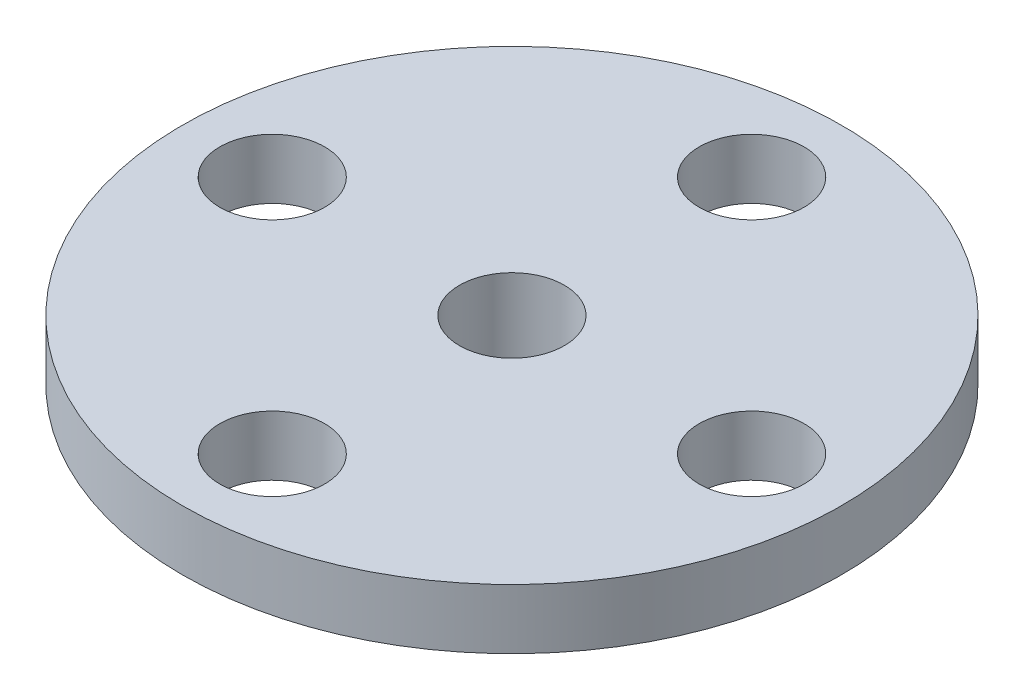
ISO-10303-21;
HEADER;
FILE_DESCRIPTION(('STEP AP214'),'2;1');
FILE_NAME('part.step','',(''),(''),'','','');
FILE_SCHEMA(('AUTOMOTIVE_DESIGN { 1 0 10303 214 1 1 1 1 }'));
ENDSEC;
DATA;
#1=APPLICATION_CONTEXT('core data for automotive mechanical design processes');
#2=APPLICATION_PROTOCOL_DEFINITION('international standard','automotive_design',2000,#1);
#3=PRODUCT_CONTEXT('',#1,'mechanical');
#4=PRODUCT('Part','Part','',(#3));
#5=PRODUCT_RELATED_PRODUCT_CATEGORY('part','',(#4));
#6=PRODUCT_DEFINITION_FORMATION('','',#4);
#7=PRODUCT_DEFINITION_CONTEXT('part definition',#1,'design');
#8=PRODUCT_DEFINITION('design','',#6,#7);
#9=PRODUCT_DEFINITION_SHAPE('','',#8);
#10=(LENGTH_UNIT() NAMED_UNIT(*) SI_UNIT(.MILLI.,.METRE.));
#11=(NAMED_UNIT(*) PLANE_ANGLE_UNIT() SI_UNIT($,.RADIAN.));
#12=(NAMED_UNIT(*) SI_UNIT($,.STERADIAN.) SOLID_ANGLE_UNIT());
#13=UNCERTAINTY_MEASURE_WITH_UNIT(LENGTH_MEASURE(1.E-05),#10,'distance_accuracy_value','');
#14=(GEOMETRIC_REPRESENTATION_CONTEXT(3) GLOBAL_UNCERTAINTY_ASSIGNED_CONTEXT((#13)) GLOBAL_UNIT_ASSIGNED_CONTEXT((#10,
#11,#12)) REPRESENTATION_CONTEXT('',''));
#15=CARTESIAN_POINT('',(0.,0.,0.));
#16=DIRECTION('',(0.,0.,1.));
#17=DIRECTION('',(1.,0.,0.));
#18=AXIS2_PLACEMENT_3D('',#15,#16,#17);
#19=CARTESIAN_POINT('',(0.,-4.2,0.));
#20=DIRECTION('',(0.,1.,0.));
#21=DIRECTION('',(0.,0.,1.));
#22=AXIS2_PLACEMENT_3D('',#19,#20,#21);
#23=PLANE('',#22);
#24=CARTESIAN_POINT('',(0.,-4.2,0.));
#25=DIRECTION('',(0.,1.,0.));
#26=DIRECTION('',(0.,0.,1.));
#27=AXIS2_PLACEMENT_3D('',#24,#25,#26);
#28=CIRCLE('',#27,2.85);
#29=CARTESIAN_POINT('',(0.,-4.2,2.85));
#30=VERTEX_POINT('',#29);
#31=EDGE_CURVE('E17',#30,#30,#28,.T.);
#32=ORIENTED_EDGE('',*,*,#31,.T.);
#33=EDGE_LOOP('',(#32));
#34=FACE_BOUND('',#33,.T.);
#35=CARTESIAN_POINT('',(0.,-4.2,0.));
#36=DIRECTION('',(0.,1.,0.));
#37=DIRECTION('',(0.,0.,1.));
#38=AXIS2_PLACEMENT_3D('',#35,#36,#37);
#39=CIRCLE('',#38,4.4);
#40=CARTESIAN_POINT('',(0.,-4.2,4.4));
#41=VERTEX_POINT('',#40);
#42=EDGE_CURVE('E63',#41,#41,#39,.T.);
#43=ORIENTED_EDGE('',*,*,#42,.F.);
#44=EDGE_LOOP('',(#43));
#45=FACE_BOUND('',#44,.T.);
#46=ADVANCED_FACE('F14',(#34,#45),#23,.F.);
#47=CARTESIAN_POINT('',(0.,-4.2,0.));
#48=DIRECTION('',(0.,1.,0.));
#49=DIRECTION('',(0.,0.,1.));
#50=AXIS2_PLACEMENT_3D('',#47,#48,#49);
#51=CYLINDRICAL_SURFACE('',#50,2.85);
#52=CARTESIAN_POINT('',(0.,-1.2,0.));
#53=DIRECTION('',(0.,1.,0.));
#54=DIRECTION('',(0.,0.,1.));
#55=AXIS2_PLACEMENT_3D('',#52,#53,#54);
#56=CIRCLE('',#55,2.85);
#57=CARTESIAN_POINT('',(0.,-1.2,2.85));
#58=VERTEX_POINT('',#57);
#59=EDGE_CURVE('E61',#58,#58,#56,.T.);
#60=ORIENTED_EDGE('',*,*,#59,.T.);
#61=EDGE_LOOP('',(#60));
#62=FACE_BOUND('',#61,.T.);
#63=ORIENTED_EDGE('',*,*,#31,.F.);
#64=EDGE_LOOP('',(#63));
#65=FACE_BOUND('',#64,.T.);
#66=ADVANCED_FACE('F72',(#62,#65),#51,.F.);
#67=CARTESIAN_POINT('',(0.,2.,0.));
#68=DIRECTION('',(0.,1.,0.));
#69=DIRECTION('',(0.,0.,1.));
#70=AXIS2_PLACEMENT_3D('',#67,#68,#69);
#71=CYLINDRICAL_SURFACE('',#70,4.4);
#72=CARTESIAN_POINT('',(0.,0.,0.));
#73=DIRECTION('',(0.,1.,0.));
#74=DIRECTION('',(0.,0.,1.));
#75=AXIS2_PLACEMENT_3D('',#72,#73,#74);
#76=CIRCLE('',#75,4.4);
#77=CARTESIAN_POINT('',(0.,0.,4.4));
#78=VERTEX_POINT('',#77);
#79=EDGE_CURVE('E58',#78,#78,#76,.F.);
#80=ORIENTED_EDGE('',*,*,#79,.T.);
#81=EDGE_LOOP('',(#80));
#82=FACE_BOUND('',#81,.T.);
#83=ORIENTED_EDGE('',*,*,#42,.T.);
#84=EDGE_LOOP('',(#83));
#85=FACE_BOUND('',#84,.T.);
#86=ADVANCED_FACE('F74',(#82,#85),#71,.T.);
#87=CARTESIAN_POINT('',(0.,-1.2,0.));
#88=DIRECTION('',(0.,1.,0.));
#89=DIRECTION('',(0.,0.,1.));
#90=AXIS2_PLACEMENT_3D('',#87,#88,#89);
#91=PLANE('',#90);
#92=CARTESIAN_POINT('',(0.,-1.2,0.));
#93=DIRECTION('',(0.,1.,0.));
#94=DIRECTION('',(0.,0.,1.));
#95=AXIS2_PLACEMENT_3D('',#92,#93,#94);
#96=CIRCLE('',#95,1.75);
#97=CARTESIAN_POINT('',(0.,-1.2,1.75));
#98=VERTEX_POINT('',#97);
#99=EDGE_CURVE('E52',#98,#98,#96,.T.);
#100=ORIENTED_EDGE('',*,*,#99,.T.);
#101=EDGE_LOOP('',(#100));
#102=FACE_BOUND('',#101,.T.);
#103=ORIENTED_EDGE('',*,*,#59,.F.);
#104=EDGE_LOOP('',(#103));
#105=FACE_BOUND('',#104,.T.);
#106=ADVANCED_FACE('F81',(#102,#105),#91,.F.);
#107=CARTESIAN_POINT('',(0.,0.,0.));
#108=DIRECTION('',(0.,1.,0.));
#109=DIRECTION('',(0.,0.,1.));
#110=AXIS2_PLACEMENT_3D('',#107,#108,#109);
#111=PLANE('',#110);
#112=CARTESIAN_POINT('',(0.,0.,-8.));
#113=DIRECTION('',(0.,1.,0.));
#114=DIRECTION('',(0.,0.,1.));
#115=AXIS2_PLACEMENT_3D('',#112,#113,#114);
#116=CIRCLE('',#115,1.75);
#117=CARTESIAN_POINT('',(0.,0.,-6.25));
#118=VERTEX_POINT('',#117);
#119=EDGE_CURVE('E40',#118,#118,#116,.T.);
#120=ORIENTED_EDGE('',*,*,#119,.T.);
#121=EDGE_LOOP('',(#120));
#122=FACE_BOUND('',#121,.T.);
#123=CARTESIAN_POINT('',(-8.,0.,0.));
#124=DIRECTION('',(0.,1.,0.));
#125=DIRECTION('',(0.,0.,1.));
#126=AXIS2_PLACEMENT_3D('',#123,#124,#125);
#127=CIRCLE('',#126,1.75);
#128=CARTESIAN_POINT('',(-8.,0.,1.75));
#129=VERTEX_POINT('',#128);
#130=EDGE_CURVE('E43',#129,#129,#127,.T.);
#131=ORIENTED_EDGE('',*,*,#130,.T.);
#132=EDGE_LOOP('',(#131));
#133=FACE_BOUND('',#132,.T.);
#134=CARTESIAN_POINT('',(0.,0.,8.));
#135=DIRECTION('',(0.,1.,0.));
#136=DIRECTION('',(0.,0.,1.));
#137=AXIS2_PLACEMENT_3D('',#134,#135,#136);
#138=CIRCLE('',#137,1.75);
#139=CARTESIAN_POINT('',(0.,0.,9.75));
#140=VERTEX_POINT('',#139);
#141=EDGE_CURVE('E46',#140,#140,#138,.T.);
#142=ORIENTED_EDGE('',*,*,#141,.T.);
#143=EDGE_LOOP('',(#142));
#144=FACE_BOUND('',#143,.T.);
#145=CARTESIAN_POINT('',(8.,0.,0.));
#146=DIRECTION('',(0.,1.,0.));
#147=DIRECTION('',(0.,0.,1.));
#148=AXIS2_PLACEMENT_3D('',#145,#146,#147);
#149=CIRCLE('',#148,1.75);
#150=CARTESIAN_POINT('',(8.,0.,1.75));
#151=VERTEX_POINT('',#150);
#152=EDGE_CURVE('E49',#151,#151,#149,.T.);
#153=ORIENTED_EDGE('',*,*,#152,.T.);
#154=EDGE_LOOP('',(#153));
#155=FACE_BOUND('',#154,.T.);
#156=ORIENTED_EDGE('',*,*,#79,.F.);
#157=EDGE_LOOP('',(#156));
#158=FACE_BOUND('',#157,.T.);
#159=CARTESIAN_POINT('',(0.,0.,0.));
#160=DIRECTION('',(0.,1.,0.));
#161=DIRECTION('',(0.,0.,1.));
#162=AXIS2_PLACEMENT_3D('',#159,#160,#161);
#163=CIRCLE('',#162,11.);
#164=CARTESIAN_POINT('',(0.,0.,11.));
#165=VERTEX_POINT('',#164);
#166=EDGE_CURVE('E55',#165,#165,#163,.T.);
#167=ORIENTED_EDGE('',*,*,#166,.F.);
#168=EDGE_LOOP('',(#167));
#169=FACE_BOUND('',#168,.T.);
#170=ADVANCED_FACE('F115',(#122,#133,#144,#155,#158,#169),#111,.F.);
#171=CARTESIAN_POINT('',(0.,0.,0.));
#172=DIRECTION('',(0.,1.,0.));
#173=DIRECTION('',(0.,0.,1.));
#174=AXIS2_PLACEMENT_3D('',#171,#172,#173);
#175=CYLINDRICAL_SURFACE('',#174,11.);
#176=CARTESIAN_POINT('',(0.,2.,0.));
#177=DIRECTION('',(0.,1.,0.));
#178=DIRECTION('',(0.,0.,1.));
#179=AXIS2_PLACEMENT_3D('',#176,#177,#178);
#180=CIRCLE('',#179,11.);
#181=CARTESIAN_POINT('',(0.,2.,11.));
#182=VERTEX_POINT('',#181);
#183=EDGE_CURVE('E37',#182,#182,#180,.T.);
#184=ORIENTED_EDGE('',*,*,#183,.F.);
#185=EDGE_LOOP('',(#184));
#186=FACE_BOUND('',#185,.T.);
#187=ORIENTED_EDGE('',*,*,#166,.T.);
#188=EDGE_LOOP('',(#187));
#189=FACE_BOUND('',#188,.T.);
#190=ADVANCED_FACE('F111',(#186,#189),#175,.T.);
#191=CARTESIAN_POINT('',(0.,-4.2,0.));
#192=DIRECTION('',(0.,1.,0.));
#193=DIRECTION('',(0.,0.,1.));
#194=AXIS2_PLACEMENT_3D('',#191,#192,#193);
#195=CYLINDRICAL_SURFACE('',#194,1.75);
#196=CARTESIAN_POINT('',(0.,2.,0.));
#197=DIRECTION('',(0.,1.,0.));
#198=DIRECTION('',(0.,0.,1.));
#199=AXIS2_PLACEMENT_3D('',#196,#197,#198);
#200=CIRCLE('',#199,1.75);
#201=CARTESIAN_POINT('',(0.,2.,1.75));
#202=VERTEX_POINT('',#201);
#203=EDGE_CURVE('E34',#202,#202,#200,.F.);
#204=ORIENTED_EDGE('',*,*,#203,.F.);
#205=EDGE_LOOP('',(#204));
#206=FACE_BOUND('',#205,.T.);
#207=ORIENTED_EDGE('',*,*,#99,.F.);
#208=EDGE_LOOP('',(#207));
#209=FACE_BOUND('',#208,.T.);
#210=ADVANCED_FACE('F107',(#206,#209),#195,.F.);
#211=CARTESIAN_POINT('',(8.,0.,0.));
#212=DIRECTION('',(0.,1.,0.));
#213=DIRECTION('',(0.,0.,1.));
#214=AXIS2_PLACEMENT_3D('',#211,#212,#213);
#215=CYLINDRICAL_SURFACE('',#214,1.75);
#216=CARTESIAN_POINT('',(8.,2.,0.));
#217=DIRECTION('',(0.,1.,0.));
#218=DIRECTION('',(0.,0.,1.));
#219=AXIS2_PLACEMENT_3D('',#216,#217,#218);
#220=CIRCLE('',#219,1.75);
#221=CARTESIAN_POINT('',(8.,2.,1.75));
#222=VERTEX_POINT('',#221);
#223=EDGE_CURVE('E31',#222,#222,#220,.F.);
#224=ORIENTED_EDGE('',*,*,#223,.F.);
#225=EDGE_LOOP('',(#224));
#226=FACE_BOUND('',#225,.T.);
#227=ORIENTED_EDGE('',*,*,#152,.F.);
#228=EDGE_LOOP('',(#227));
#229=FACE_BOUND('',#228,.T.);
#230=ADVANCED_FACE('F103',(#226,#229),#215,.F.);
#231=CARTESIAN_POINT('',(0.,0.,8.));
#232=DIRECTION('',(0.,1.,0.));
#233=DIRECTION('',(0.,0.,1.));
#234=AXIS2_PLACEMENT_3D('',#231,#232,#233);
#235=CYLINDRICAL_SURFACE('',#234,1.75);
#236=CARTESIAN_POINT('',(0.,2.,8.));
#237=DIRECTION('',(0.,1.,0.));
#238=DIRECTION('',(0.,0.,1.));
#239=AXIS2_PLACEMENT_3D('',#236,#237,#238);
#240=CIRCLE('',#239,1.75);
#241=CARTESIAN_POINT('',(0.,2.,9.75));
#242=VERTEX_POINT('',#241);
#243=EDGE_CURVE('E26',#242,#242,#240,.F.);
#244=ORIENTED_EDGE('',*,*,#243,.F.);
#245=EDGE_LOOP('',(#244));
#246=FACE_BOUND('',#245,.T.);
#247=ORIENTED_EDGE('',*,*,#141,.F.);
#248=EDGE_LOOP('',(#247));
#249=FACE_BOUND('',#248,.T.);
#250=ADVANCED_FACE('F99',(#246,#249),#235,.F.);
#251=CARTESIAN_POINT('',(-8.,0.,0.));
#252=DIRECTION('',(0.,1.,0.));
#253=DIRECTION('',(0.,0.,1.));
#254=AXIS2_PLACEMENT_3D('',#251,#252,#253);
#255=CYLINDRICAL_SURFACE('',#254,1.75);
#256=CARTESIAN_POINT('',(-8.,2.,0.));
#257=DIRECTION('',(0.,1.,0.));
#258=DIRECTION('',(0.,0.,1.));
#259=AXIS2_PLACEMENT_3D('',#256,#257,#258);
#260=CIRCLE('',#259,1.75);
#261=CARTESIAN_POINT('',(-8.,2.,1.75));
#262=VERTEX_POINT('',#261);
#263=EDGE_CURVE('E21',#262,#262,#260,.F.);
#264=ORIENTED_EDGE('',*,*,#263,.F.);
#265=EDGE_LOOP('',(#264));
#266=FACE_BOUND('',#265,.T.);
#267=ORIENTED_EDGE('',*,*,#130,.F.);
#268=EDGE_LOOP('',(#267));
#269=FACE_BOUND('',#268,.T.);
#270=ADVANCED_FACE('F92',(#266,#269),#255,.F.);
#271=CARTESIAN_POINT('',(0.,0.,-8.));
#272=DIRECTION('',(0.,1.,0.));
#273=DIRECTION('',(0.,0.,1.));
#274=AXIS2_PLACEMENT_3D('',#271,#272,#273);
#275=CYLINDRICAL_SURFACE('',#274,1.75);
#276=CARTESIAN_POINT('',(0.,2.,-8.));
#277=DIRECTION('',(0.,1.,0.));
#278=DIRECTION('',(0.,0.,1.));
#279=AXIS2_PLACEMENT_3D('',#276,#277,#278);
#280=CIRCLE('',#279,1.75);
#281=CARTESIAN_POINT('',(0.,2.,-6.25));
#282=VERTEX_POINT('',#281);
#283=EDGE_CURVE('E10',#282,#282,#280,.F.);
#284=ORIENTED_EDGE('',*,*,#283,.F.);
#285=EDGE_LOOP('',(#284));
#286=FACE_BOUND('',#285,.T.);
#287=ORIENTED_EDGE('',*,*,#119,.F.);
#288=EDGE_LOOP('',(#287));
#289=FACE_BOUND('',#288,.T.);
#290=ADVANCED_FACE('F87',(#286,#289),#275,.F.);
#291=CARTESIAN_POINT('',(0.,2.,0.));
#292=DIRECTION('',(0.,1.,0.));
#293=DIRECTION('',(0.,0.,1.));
#294=AXIS2_PLACEMENT_3D('',#291,#292,#293);
#295=PLANE('',#294);
#296=ORIENTED_EDGE('',*,*,#283,.T.);
#297=EDGE_LOOP('',(#296));
#298=FACE_BOUND('',#297,.T.);
#299=ORIENTED_EDGE('',*,*,#263,.T.);
#300=EDGE_LOOP('',(#299));
#301=FACE_BOUND('',#300,.T.);
#302=ORIENTED_EDGE('',*,*,#243,.T.);
#303=EDGE_LOOP('',(#302));
#304=FACE_BOUND('',#303,.T.);
#305=ORIENTED_EDGE('',*,*,#223,.T.);
#306=EDGE_LOOP('',(#305));
#307=FACE_BOUND('',#306,.T.);
#308=ORIENTED_EDGE('',*,*,#203,.T.);
#309=EDGE_LOOP('',(#308));
#310=FACE_BOUND('',#309,.T.);
#311=ORIENTED_EDGE('',*,*,#183,.T.);
#312=EDGE_LOOP('',(#311));
#313=FACE_BOUND('',#312,.T.);
#314=ADVANCED_FACE('F85',(#298,#301,#304,#307,#310,#313),#295,.T.);
#315=CLOSED_SHELL('',(#46,#66,#86,#106,#170,#190,#210,#230,#250,#270,#290,#314));
#316=MANIFOLD_SOLID_BREP('B1',#315);
#317=ADVANCED_BREP_SHAPE_REPRESENTATION('',(#18,#316),#14);
#318=SHAPE_DEFINITION_REPRESENTATION(#9,#317);
ENDSEC;
END-ISO-10303-21;
